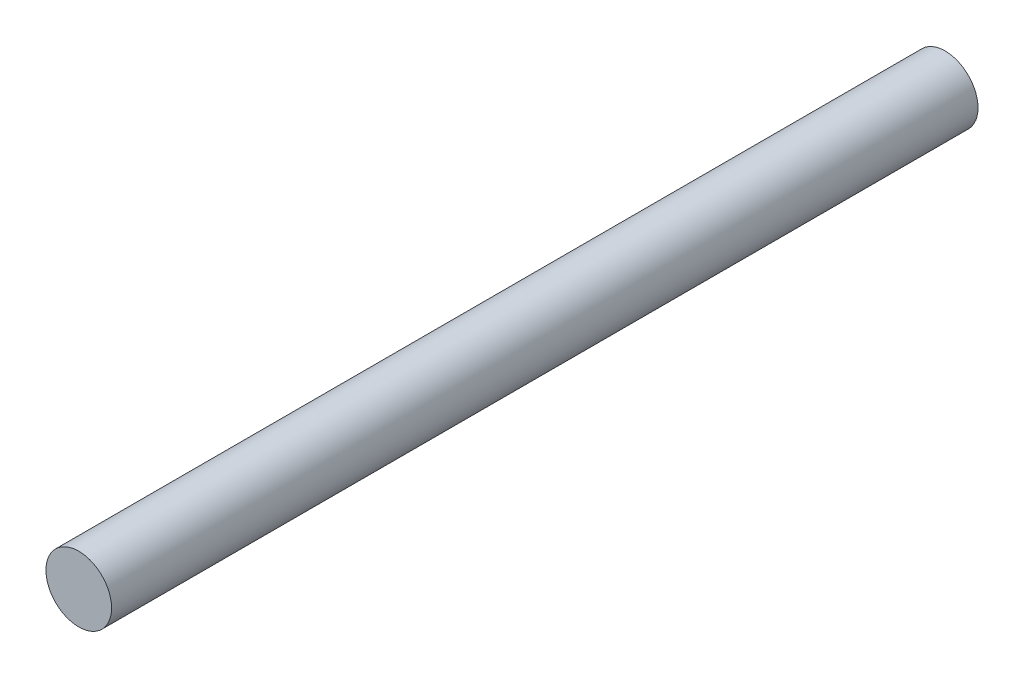
ISO-10303-21;
HEADER;
FILE_DESCRIPTION(('STEP AP214'),'2;1');
FILE_NAME('part.step','',(''),(''),'','','');
FILE_SCHEMA(('AUTOMOTIVE_DESIGN { 1 0 10303 214 1 1 1 1 }'));
ENDSEC;
DATA;
#1=APPLICATION_CONTEXT('core data for automotive mechanical design processes');
#2=APPLICATION_PROTOCOL_DEFINITION('international standard','automotive_design',2000,#1);
#3=PRODUCT_CONTEXT('',#1,'mechanical');
#4=PRODUCT('Part','Part','',(#3));
#5=PRODUCT_RELATED_PRODUCT_CATEGORY('part','',(#4));
#6=PRODUCT_DEFINITION_FORMATION('','',#4);
#7=PRODUCT_DEFINITION_CONTEXT('part definition',#1,'design');
#8=PRODUCT_DEFINITION('design','',#6,#7);
#9=PRODUCT_DEFINITION_SHAPE('','',#8);
#10=(LENGTH_UNIT() NAMED_UNIT(*) SI_UNIT(.MILLI.,.METRE.));
#11=(NAMED_UNIT(*) PLANE_ANGLE_UNIT() SI_UNIT($,.RADIAN.));
#12=(NAMED_UNIT(*) SI_UNIT($,.STERADIAN.) SOLID_ANGLE_UNIT());
#13=UNCERTAINTY_MEASURE_WITH_UNIT(LENGTH_MEASURE(1.E-05),#10,'distance_accuracy_value','');
#14=(GEOMETRIC_REPRESENTATION_CONTEXT(3) GLOBAL_UNCERTAINTY_ASSIGNED_CONTEXT((#13)) GLOBAL_UNIT_ASSIGNED_CONTEXT((#10,
#11,#12)) REPRESENTATION_CONTEXT('',''));
#15=CARTESIAN_POINT('',(0.,0.,0.));
#16=DIRECTION('',(0.,0.,1.));
#17=DIRECTION('',(1.,0.,0.));
#18=AXIS2_PLACEMENT_3D('',#15,#16,#17);
#19=CARTESIAN_POINT('',(0.,0.,-33.));
#20=DIRECTION('',(0.,0.,-1.));
#21=DIRECTION('',(-1.,0.,0.));
#22=AXIS2_PLACEMENT_3D('',#19,#20,#21);
#23=PLANE('',#22);
#24=CARTESIAN_POINT('',(0.,0.,-33.));
#25=DIRECTION('',(0.,0.,1.));
#26=DIRECTION('',(1.,0.,0.));
#27=AXIS2_PLACEMENT_3D('',#24,#25,#26);
#28=CIRCLE('',#27,2.50000000000001);
#29=CARTESIAN_POINT('',(2.50000000000001,0.,-33.));
#30=VERTEX_POINT('',#29);
#31=EDGE_CURVE('E10',#30,#30,#28,.T.);
#32=ORIENTED_EDGE('',*,*,#31,.F.);
#33=EDGE_LOOP('',(#32));
#34=FACE_BOUND('',#33,.T.);
#35=ADVANCED_FACE('F31',(#34),#23,.T.);
#36=CARTESIAN_POINT('',(0.,0.,53.7838213269522));
#37=DIRECTION('',(0.,0.,1.));
#38=DIRECTION('',(1.,0.,0.));
#39=AXIS2_PLACEMENT_3D('',#36,#37,#38);
#40=CYLINDRICAL_SURFACE('',#39,2.50000000000001);
#41=ORIENTED_EDGE('',*,*,#31,.T.);
#42=EDGE_LOOP('',(#41));
#43=FACE_BOUND('',#42,.T.);
#44=CARTESIAN_POINT('',(0.,0.,33.));
#45=DIRECTION('',(0.,0.,1.));
#46=DIRECTION('',(1.,0.,0.));
#47=AXIS2_PLACEMENT_3D('',#44,#45,#46);
#48=CIRCLE('',#47,2.50000000000001);
#49=CARTESIAN_POINT('',(2.50000000000001,0.,33.));
#50=VERTEX_POINT('',#49);
#51=EDGE_CURVE('E37',#50,#50,#48,.T.);
#52=ORIENTED_EDGE('',*,*,#51,.F.);
#53=EDGE_LOOP('',(#52));
#54=FACE_BOUND('',#53,.T.);
#55=ADVANCED_FACE('F45',(#43,#54),#40,.T.);
#56=CARTESIAN_POINT('',(2.50000000000001,0.,33.));
#57=DIRECTION('',(0.,0.,1.));
#58=DIRECTION('',(1.,0.,0.));
#59=AXIS2_PLACEMENT_3D('',#56,#57,#58);
#60=PLANE('',#59);
#61=ORIENTED_EDGE('',*,*,#51,.T.);
#62=EDGE_LOOP('',(#61));
#63=FACE_BOUND('',#62,.T.);
#64=ADVANCED_FACE('F43',(#63),#60,.T.);
#65=CLOSED_SHELL('',(#35,#55,#64));
#66=MANIFOLD_SOLID_BREP('B2',#65);
#67=ADVANCED_BREP_SHAPE_REPRESENTATION('',(#18,#66),#14);
#68=SHAPE_DEFINITION_REPRESENTATION(#9,#67);
ENDSEC;
END-ISO-10303-21;
